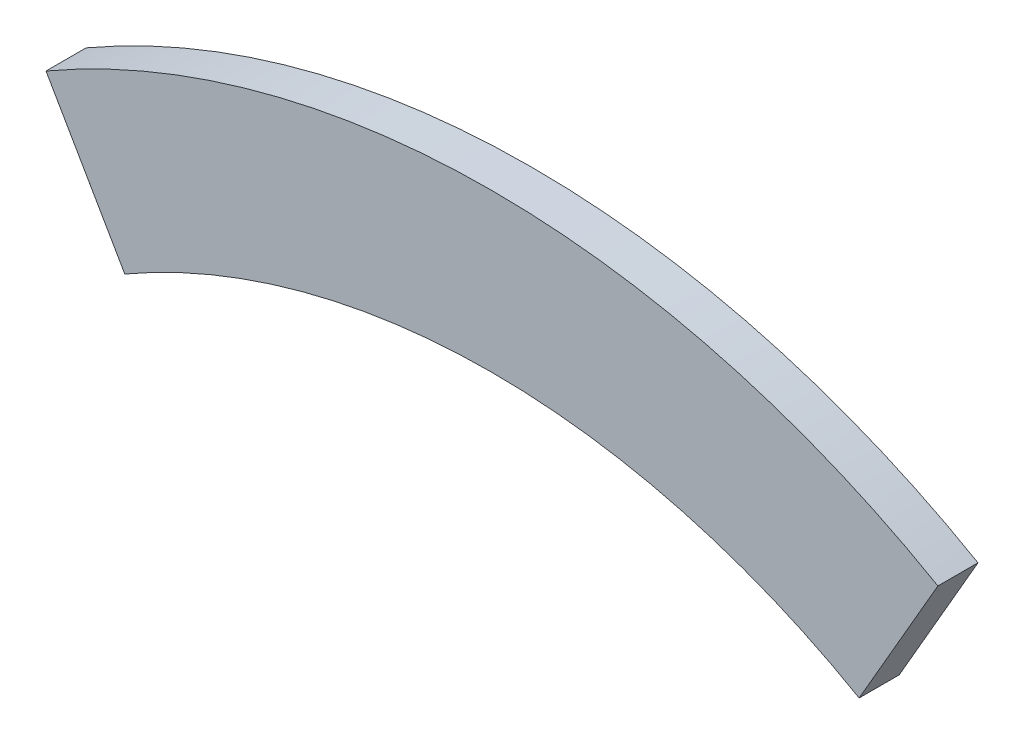
ISO-10303-21;
HEADER;
FILE_DESCRIPTION(('STEP AP214'),'2;1');
FILE_NAME('part.step','',(''),(''),'','','');
FILE_SCHEMA(('AUTOMOTIVE_DESIGN { 1 0 10303 214 1 1 1 1 }'));
ENDSEC;
DATA;
#1=APPLICATION_CONTEXT('core data for automotive mechanical design processes');
#2=APPLICATION_PROTOCOL_DEFINITION('international standard','automotive_design',2000,#1);
#3=PRODUCT_CONTEXT('',#1,'mechanical');
#4=PRODUCT('Part','Part','',(#3));
#5=PRODUCT_RELATED_PRODUCT_CATEGORY('part','',(#4));
#6=PRODUCT_DEFINITION_FORMATION('','',#4);
#7=PRODUCT_DEFINITION_CONTEXT('part definition',#1,'design');
#8=PRODUCT_DEFINITION('design','',#6,#7);
#9=PRODUCT_DEFINITION_SHAPE('','',#8);
#10=(LENGTH_UNIT() NAMED_UNIT(*) SI_UNIT(.MILLI.,.METRE.));
#11=(NAMED_UNIT(*) PLANE_ANGLE_UNIT() SI_UNIT($,.RADIAN.));
#12=(NAMED_UNIT(*) SI_UNIT($,.STERADIAN.) SOLID_ANGLE_UNIT());
#13=UNCERTAINTY_MEASURE_WITH_UNIT(LENGTH_MEASURE(1.E-05),#10,'distance_accuracy_value','');
#14=(GEOMETRIC_REPRESENTATION_CONTEXT(3) GLOBAL_UNCERTAINTY_ASSIGNED_CONTEXT((#13)) GLOBAL_UNIT_ASSIGNED_CONTEXT((#10,
#11,#12)) REPRESENTATION_CONTEXT('',''));
#15=CARTESIAN_POINT('',(0.,0.,0.));
#16=DIRECTION('',(0.,0.,1.));
#17=DIRECTION('',(1.,0.,0.));
#18=AXIS2_PLACEMENT_3D('',#15,#16,#17);
#19=CARTESIAN_POINT('',(0.,0.,25.4));
#20=DIRECTION('',(0.,0.,-1.));
#21=DIRECTION('',(-1.,0.,0.));
#22=AXIS2_PLACEMENT_3D('',#19,#20,#21);
#23=CYLINDRICAL_SURFACE('',#22,465.328);
#24=CARTESIAN_POINT('',(0.,0.,0.));
#25=DIRECTION('',(0.,0.,-1.));
#26=DIRECTION('',(1.,0.,0.));
#27=AXIS2_PLACEMENT_3D('',#24,#25,#26);
#28=CIRCLE('',#27,465.328);
#29=CARTESIAN_POINT('',(-232.663999999999,402.985869092206,0.));
#30=VERTEX_POINT('',#29);
#31=CARTESIAN_POINT('',(232.663999999999,402.985869092206,0.));
#32=VERTEX_POINT('',#31);
#33=EDGE_CURVE('E100',#30,#32,#28,.T.);
#34=ORIENTED_EDGE('',*,*,#33,.T.);
#35=DIRECTION('',(0.,0.,-1.));
#36=VECTOR('',#35,1.);
#37=CARTESIAN_POINT('',(232.663999999999,402.985869092206,25.4));
#38=LINE('',#37,#36);
#39=CARTESIAN_POINT('',(232.663999999999,402.985869092206,25.4));
#40=VERTEX_POINT('',#39);
#41=EDGE_CURVE('E11',#40,#32,#38,.T.);
#42=ORIENTED_EDGE('',*,*,#41,.F.);
#43=CARTESIAN_POINT('',(0.,0.,25.4));
#44=DIRECTION('',(0.,0.,-1.));
#45=DIRECTION('',(1.,0.,0.));
#46=AXIS2_PLACEMENT_3D('',#43,#44,#45);
#47=CIRCLE('',#46,465.328);
#48=CARTESIAN_POINT('',(-232.663999999999,402.985869092206,25.4));
#49=VERTEX_POINT('',#48);
#50=EDGE_CURVE('E88',#49,#40,#47,.T.);
#51=ORIENTED_EDGE('',*,*,#50,.F.);
#52=DIRECTION('',(0.,0.,-1.));
#53=VECTOR('',#52,1.);
#54=CARTESIAN_POINT('',(-232.663999999999,402.985869092206,25.4));
#55=LINE('',#54,#53);
#56=EDGE_CURVE('E96',#49,#30,#55,.T.);
#57=ORIENTED_EDGE('',*,*,#56,.T.);
#58=EDGE_LOOP('',(#34,#42,#51,#57));
#59=FACE_BOUND('',#58,.T.);
#60=ADVANCED_FACE('F37',(#59),#23,.F.);
#61=CARTESIAN_POINT('',(282.574999999999,489.434256948776,25.4));
#62=DIRECTION('',(-0.866025403784439,0.499999999999999,0.));
#63=DIRECTION('',(-0.499999999999999,-0.866025403784439,0.));
#64=AXIS2_PLACEMENT_3D('',#61,#62,#63);
#65=PLANE('',#64);
#66=DIRECTION('',(0.499999999999999,0.866025403784439,0.));
#67=VECTOR('',#66,1.);
#68=CARTESIAN_POINT('',(282.574999999999,489.434256948776,0.));
#69=LINE('',#68,#67);
#70=CARTESIAN_POINT('',(282.574999999999,489.434256948776,0.));
#71=VERTEX_POINT('',#70);
#72=EDGE_CURVE('E92',#32,#71,#69,.T.);
#73=ORIENTED_EDGE('',*,*,#72,.T.);
#74=DIRECTION('',(0.,0.,-1.));
#75=VECTOR('',#74,1.);
#76=CARTESIAN_POINT('',(282.574999999999,489.434256948776,25.4));
#77=LINE('',#76,#75);
#78=CARTESIAN_POINT('',(282.574999999999,489.434256948776,25.4));
#79=VERTEX_POINT('',#78);
#80=EDGE_CURVE('E45',#79,#71,#77,.T.);
#81=ORIENTED_EDGE('',*,*,#80,.F.);
#82=DIRECTION('',(0.499999999999999,0.866025403784439,0.));
#83=VECTOR('',#82,1.);
#84=CARTESIAN_POINT('',(282.574999999999,489.434256948776,25.4));
#85=LINE('',#84,#83);
#86=EDGE_CURVE('E83',#40,#79,#85,.T.);
#87=ORIENTED_EDGE('',*,*,#86,.F.);
#88=ORIENTED_EDGE('',*,*,#41,.T.);
#89=EDGE_LOOP('',(#73,#81,#87,#88));
#90=FACE_BOUND('',#89,.T.);
#91=ADVANCED_FACE('F91',(#90),#65,.F.);
#92=CARTESIAN_POINT('',(0.,0.,25.4));
#93=DIRECTION('',(0.,0.,-1.));
#94=DIRECTION('',(-1.,0.,0.));
#95=AXIS2_PLACEMENT_3D('',#92,#93,#94);
#96=CYLINDRICAL_SURFACE('',#95,565.15);
#97=CARTESIAN_POINT('',(0.,0.,0.));
#98=DIRECTION('',(0.,0.,1.));
#99=DIRECTION('',(1.,0.,0.));
#100=AXIS2_PLACEMENT_3D('',#97,#98,#99);
#101=CIRCLE('',#100,565.15);
#102=CARTESIAN_POINT('',(-282.574999999999,489.434256948776,0.));
#103=VERTEX_POINT('',#102);
#104=EDGE_CURVE('E70',#71,#103,#101,.T.);
#105=ORIENTED_EDGE('',*,*,#104,.T.);
#106=DIRECTION('',(0.,0.,-1.));
#107=VECTOR('',#106,1.);
#108=CARTESIAN_POINT('',(-282.574999999999,489.434256948776,25.4));
#109=LINE('',#108,#107);
#110=CARTESIAN_POINT('',(-282.574999999999,489.434256948776,25.4));
#111=VERTEX_POINT('',#110);
#112=EDGE_CURVE('E93',#111,#103,#109,.T.);
#113=ORIENTED_EDGE('',*,*,#112,.F.);
#114=CARTESIAN_POINT('',(0.,0.,25.4));
#115=DIRECTION('',(0.,0.,1.));
#116=DIRECTION('',(1.,0.,0.));
#117=AXIS2_PLACEMENT_3D('',#114,#115,#116);
#118=CIRCLE('',#117,565.15);
#119=EDGE_CURVE('E86',#79,#111,#118,.T.);
#120=ORIENTED_EDGE('',*,*,#119,.F.);
#121=ORIENTED_EDGE('',*,*,#80,.T.);
#122=EDGE_LOOP('',(#105,#113,#120,#121));
#123=FACE_BOUND('',#122,.T.);
#124=ADVANCED_FACE('F94',(#123),#96,.T.);
#125=CARTESIAN_POINT('',(-232.663999999999,402.985869092206,25.4));
#126=DIRECTION('',(0.866025403784436,0.500000000000005,0.));
#127=DIRECTION('',(-0.500000000000005,0.866025403784436,0.));
#128=AXIS2_PLACEMENT_3D('',#125,#126,#127);
#129=PLANE('',#128);
#130=DIRECTION('',(0.500000000000005,-0.866025403784436,0.));
#131=VECTOR('',#130,1.);
#132=CARTESIAN_POINT('',(-232.663999999999,402.985869092206,0.));
#133=LINE('',#132,#131);
#134=EDGE_CURVE('E76',#103,#30,#133,.T.);
#135=ORIENTED_EDGE('',*,*,#134,.T.);
#136=ORIENTED_EDGE('',*,*,#56,.F.);
#137=DIRECTION('',(0.500000000000005,-0.866025403784436,0.));
#138=VECTOR('',#137,1.);
#139=CARTESIAN_POINT('',(-232.663999999999,402.985869092206,25.4));
#140=LINE('',#139,#138);
#141=EDGE_CURVE('E53',#111,#49,#140,.T.);
#142=ORIENTED_EDGE('',*,*,#141,.F.);
#143=ORIENTED_EDGE('',*,*,#112,.T.);
#144=EDGE_LOOP('',(#135,#136,#142,#143));
#145=FACE_BOUND('',#144,.T.);
#146=ADVANCED_FACE('F107',(#145),#129,.F.);
#147=CARTESIAN_POINT('',(0.,0.,25.4));
#148=DIRECTION('',(0.,0.,1.));
#149=DIRECTION('',(1.,0.,0.));
#150=AXIS2_PLACEMENT_3D('',#147,#148,#149);
#151=PLANE('',#150);
#152=ORIENTED_EDGE('',*,*,#50,.T.);
#153=ORIENTED_EDGE('',*,*,#86,.T.);
#154=ORIENTED_EDGE('',*,*,#119,.T.);
#155=ORIENTED_EDGE('',*,*,#141,.T.);
#156=EDGE_LOOP('',(#152,#153,#154,#155));
#157=FACE_BOUND('',#156,.T.);
#158=ADVANCED_FACE('F84',(#157),#151,.T.);
#159=CARTESIAN_POINT('',(0.,0.,0.));
#160=DIRECTION('',(0.,0.,1.));
#161=DIRECTION('',(1.,0.,0.));
#162=AXIS2_PLACEMENT_3D('',#159,#160,#161);
#163=PLANE('',#162);
#164=ORIENTED_EDGE('',*,*,#33,.F.);
#165=ORIENTED_EDGE('',*,*,#134,.F.);
#166=ORIENTED_EDGE('',*,*,#104,.F.);
#167=ORIENTED_EDGE('',*,*,#72,.F.);
#168=EDGE_LOOP('',(#164,#165,#166,#167));
#169=FACE_BOUND('',#168,.T.);
#170=ADVANCED_FACE('F110',(#169),#163,.F.);
#171=CLOSED_SHELL('',(#60,#91,#124,#146,#158,#170));
#172=MANIFOLD_SOLID_BREP('B2',#171);
#173=ADVANCED_BREP_SHAPE_REPRESENTATION('',(#18,#172),#14);
#174=SHAPE_DEFINITION_REPRESENTATION(#9,#173);
ENDSEC;
END-ISO-10303-21;
